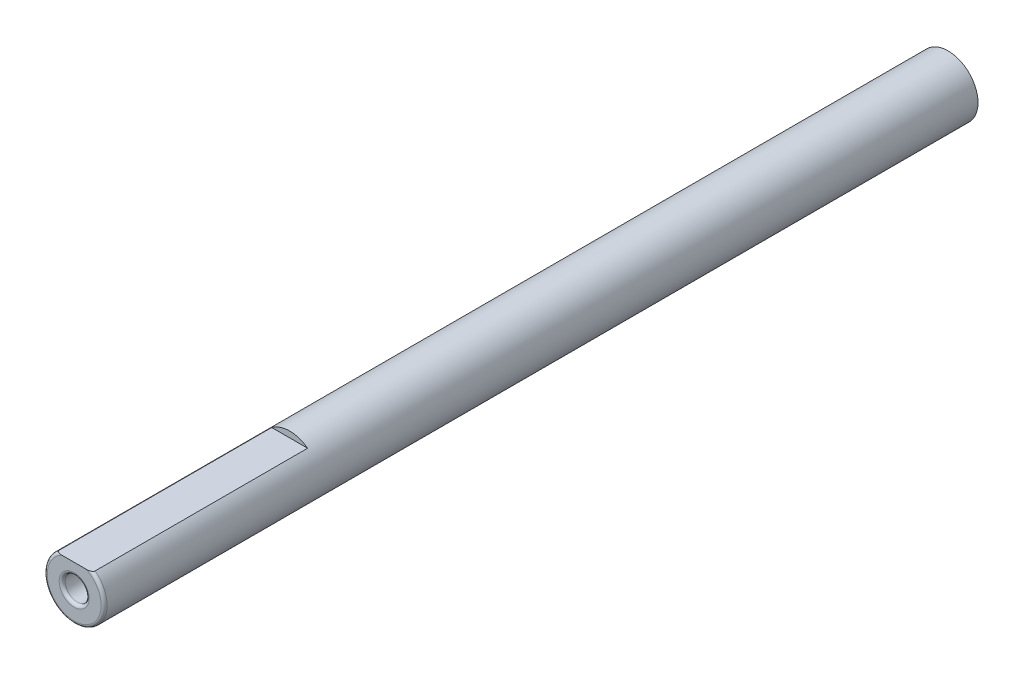
ISO-10303-21;
HEADER;
FILE_DESCRIPTION(('STEP AP214'),'2;1');
FILE_NAME('part.step','',(''),(''),'','','');
FILE_SCHEMA(('AUTOMOTIVE_DESIGN { 1 0 10303 214 1 1 1 1 }'));
ENDSEC;
DATA;
#1=APPLICATION_CONTEXT('core data for automotive mechanical design processes');
#2=APPLICATION_PROTOCOL_DEFINITION('international standard','automotive_design',2000,#1);
#3=PRODUCT_CONTEXT('',#1,'mechanical');
#4=PRODUCT('Part','Part','',(#3));
#5=PRODUCT_RELATED_PRODUCT_CATEGORY('part','',(#4));
#6=PRODUCT_DEFINITION_FORMATION('','',#4);
#7=PRODUCT_DEFINITION_CONTEXT('part definition',#1,'design');
#8=PRODUCT_DEFINITION('design','',#6,#7);
#9=PRODUCT_DEFINITION_SHAPE('','',#8);
#10=(LENGTH_UNIT() NAMED_UNIT(*) SI_UNIT(.MILLI.,.METRE.));
#11=(NAMED_UNIT(*) PLANE_ANGLE_UNIT() SI_UNIT($,.RADIAN.));
#12=(NAMED_UNIT(*) SI_UNIT($,.STERADIAN.) SOLID_ANGLE_UNIT());
#13=UNCERTAINTY_MEASURE_WITH_UNIT(LENGTH_MEASURE(1.E-05),#10,'distance_accuracy_value','');
#14=(GEOMETRIC_REPRESENTATION_CONTEXT(3) GLOBAL_UNCERTAINTY_ASSIGNED_CONTEXT((#13)) GLOBAL_UNIT_ASSIGNED_CONTEXT((#10,
#11,#12)) REPRESENTATION_CONTEXT('',''));
#15=CARTESIAN_POINT('',(0.,0.,0.));
#16=DIRECTION('',(0.,0.,1.));
#17=DIRECTION('',(1.,0.,0.));
#18=AXIS2_PLACEMENT_3D('',#15,#16,#17);
#19=CARTESIAN_POINT('',(0.,0.,73.));
#20=DIRECTION('',(0.,0.,-1.));
#21=DIRECTION('',(-1.,0.,0.));
#22=AXIS2_PLACEMENT_3D('',#19,#20,#21);
#23=CYLINDRICAL_SURFACE('',#22,2.5);
#24=CARTESIAN_POINT('',(0.,0.,72.75));
#25=DIRECTION('',(0.,0.,1.));
#26=DIRECTION('',(1.,0.,0.));
#27=AXIS2_PLACEMENT_3D('',#24,#25,#26);
#28=CIRCLE('',#27,2.5);
#29=CARTESIAN_POINT('',(1.5,2.,72.7499999999999));
#30=VERTEX_POINT('',#29);
#31=CARTESIAN_POINT('',(-1.5,2.,72.7500000000001));
#32=VERTEX_POINT('',#31);
#33=EDGE_CURVE('E84',#30,#32,#28,.F.);
#34=ORIENTED_EDGE('',*,*,#33,.T.);
#35=DIRECTION('',(0.,0.,1.));
#36=VECTOR('',#35,1.);
#37=CARTESIAN_POINT('',(-1.5,2.,55.));
#38=LINE('',#37,#36);
#39=CARTESIAN_POINT('',(-1.5,2.,55.));
#40=VERTEX_POINT('',#39);
#41=EDGE_CURVE('E77',#40,#32,#38,.T.);
#42=ORIENTED_EDGE('',*,*,#41,.F.);
#43=CARTESIAN_POINT('',(0.,0.,55.));
#44=DIRECTION('',(0.,0.,1.));
#45=DIRECTION('',(1.,0.,0.));
#46=AXIS2_PLACEMENT_3D('',#43,#44,#45);
#47=CIRCLE('',#46,2.5);
#48=CARTESIAN_POINT('',(1.5,2.,55.));
#49=VERTEX_POINT('',#48);
#50=EDGE_CURVE('E69',#49,#40,#47,.T.);
#51=ORIENTED_EDGE('',*,*,#50,.F.);
#52=DIRECTION('',(0.,0.,1.));
#53=VECTOR('',#52,1.);
#54=CARTESIAN_POINT('',(1.5,2.,55.));
#55=LINE('',#54,#53);
#56=EDGE_CURVE('E79',#49,#30,#55,.T.);
#57=ORIENTED_EDGE('',*,*,#56,.T.);
#58=EDGE_LOOP('',(#34,#42,#51,#57));
#59=FACE_BOUND('',#58,.T.);
#60=CARTESIAN_POINT('',(0.,0.,0.));
#61=DIRECTION('',(0.,0.,1.));
#62=DIRECTION('',(1.,0.,0.));
#63=AXIS2_PLACEMENT_3D('',#60,#61,#62);
#64=CIRCLE('',#63,2.5);
#65=CARTESIAN_POINT('',(2.5,0.,0.));
#66=VERTEX_POINT('',#65);
#67=EDGE_CURVE('E92',#66,#66,#64,.T.);
#68=ORIENTED_EDGE('',*,*,#67,.T.);
#69=EDGE_LOOP('',(#68));
#70=FACE_BOUND('',#69,.T.);
#71=ADVANCED_FACE('F34',(#59,#70),#23,.T.);
#72=CARTESIAN_POINT('',(0.,0.,73.));
#73=DIRECTION('',(0.,0.,1.));
#74=DIRECTION('',(1.,0.,0.));
#75=AXIS2_PLACEMENT_3D('',#72,#73,#74);
#76=PLANE('',#75);
#77=DIRECTION('',(1.,0.,0.));
#78=VECTOR('',#77,1.);
#79=CARTESIAN_POINT('',(-1.5,2.,73.));
#80=LINE('',#79,#78);
#81=CARTESIAN_POINT('',(-1.03077640640442,2.,73.));
#82=VERTEX_POINT('',#81);
#83=CARTESIAN_POINT('',(1.03077640640442,2.,73.));
#84=VERTEX_POINT('',#83);
#85=EDGE_CURVE('E52',#82,#84,#80,.T.);
#86=ORIENTED_EDGE('',*,*,#85,.F.);
#87=CARTESIAN_POINT('',(0.,0.,73.));
#88=DIRECTION('',(0.,0.,1.));
#89=DIRECTION('',(1.,0.,0.));
#90=AXIS2_PLACEMENT_3D('',#87,#88,#89);
#91=CIRCLE('',#90,2.25);
#92=EDGE_CURVE('E99',#82,#84,#91,.T.);
#93=ORIENTED_EDGE('',*,*,#92,.T.);
#94=EDGE_LOOP('',(#86,#93));
#95=FACE_BOUND('',#94,.T.);
#96=CARTESIAN_POINT('',(0.,0.,73.));
#97=DIRECTION('',(0.,0.,1.));
#98=DIRECTION('',(1.,0.,0.));
#99=AXIS2_PLACEMENT_3D('',#96,#97,#98);
#100=CIRCLE('',#99,1.25);
#101=CARTESIAN_POINT('',(1.25,0.,73.));
#102=VERTEX_POINT('',#101);
#103=EDGE_CURVE('E96',#102,#102,#100,.F.);
#104=ORIENTED_EDGE('',*,*,#103,.T.);
#105=EDGE_LOOP('',(#104));
#106=FACE_BOUND('',#105,.T.);
#107=ADVANCED_FACE('F125',(#95,#106),#76,.T.);
#108=CARTESIAN_POINT('',(0.,0.,0.));
#109=DIRECTION('',(0.,0.,1.));
#110=DIRECTION('',(1.,0.,0.));
#111=AXIS2_PLACEMENT_3D('',#108,#109,#110);
#112=PLANE('',#111);
#113=ORIENTED_EDGE('',*,*,#67,.F.);
#114=EDGE_LOOP('',(#113));
#115=FACE_BOUND('',#114,.T.);
#116=ADVANCED_FACE('F123',(#115),#112,.F.);
#117=CARTESIAN_POINT('',(0.,0.,63.));
#118=DIRECTION('',(0.,0.,1.));
#119=DIRECTION('',(1.,0.,0.));
#120=AXIS2_PLACEMENT_3D('',#117,#118,#119);
#121=CYLINDRICAL_SURFACE('',#120,1.);
#122=CARTESIAN_POINT('',(0.,0.,72.75));
#123=DIRECTION('',(0.,0.,1.));
#124=DIRECTION('',(1.,0.,0.));
#125=AXIS2_PLACEMENT_3D('',#122,#123,#124);
#126=CIRCLE('',#125,1.);
#127=CARTESIAN_POINT('',(1.,0.,72.75));
#128=VERTEX_POINT('',#127);
#129=EDGE_CURVE('E103',#128,#128,#126,.T.);
#130=ORIENTED_EDGE('',*,*,#129,.T.);
#131=EDGE_LOOP('',(#130));
#132=FACE_BOUND('',#131,.T.);
#133=CARTESIAN_POINT('',(0.,0.,63.));
#134=DIRECTION('',(0.,0.,1.));
#135=DIRECTION('',(1.,0.,0.));
#136=AXIS2_PLACEMENT_3D('',#133,#134,#135);
#137=CIRCLE('',#136,1.);
#138=CARTESIAN_POINT('',(1.,0.,63.));
#139=VERTEX_POINT('',#138);
#140=EDGE_CURVE('E86',#139,#139,#137,.T.);
#141=ORIENTED_EDGE('',*,*,#140,.F.);
#142=EDGE_LOOP('',(#141));
#143=FACE_BOUND('',#142,.T.);
#144=ADVANCED_FACE('F119',(#132,#143),#121,.F.);
#145=CARTESIAN_POINT('',(0.,0.,63.));
#146=DIRECTION('',(0.,0.,1.));
#147=DIRECTION('',(1.,0.,0.));
#148=AXIS2_PLACEMENT_3D('',#145,#146,#147);
#149=PLANE('',#148);
#150=ORIENTED_EDGE('',*,*,#140,.T.);
#151=EDGE_LOOP('',(#150));
#152=FACE_BOUND('',#151,.T.);
#153=ADVANCED_FACE('F115',(#152),#149,.T.);
#154=CARTESIAN_POINT('',(0.,0.,72.75));
#155=DIRECTION('',(0.,0.,1.));
#156=DIRECTION('',(1.,0.,0.));
#157=AXIS2_PLACEMENT_3D('',#154,#155,#156);
#158=TOROIDAL_SURFACE('',#157,2.25,0.25);
#159=CARTESIAN_POINT('',(0.,2.,72.75));
#160=CARTESIAN_POINT('',(4.60447977303265E-11,2.,72.7499994316429));
#161=CARTESIAN_POINT('',(-1.41908550602303E-07,2.,72.7499988632743));
#162=CARTESIAN_POINT('',(-5.76353339906845E-07,2.,72.7499977781027));
#163=CARTESIAN_POINT('',(-8.74667841472388E-07,2.,72.7499972642924));
#164=CARTESIAN_POINT('',(-1.58830851072497E-06,2.,72.7499962318158));
#165=CARTESIAN_POINT('',(-2.01336970471725E-06,2.,72.7499957199378));
#166=CARTESIAN_POINT('',(-2.92050402588945E-06,2.,72.7499947653601));
#167=CARTESIAN_POINT('',(-3.40176908275082E-06,2.,72.7499943218515));
#168=CARTESIAN_POINT('',(-5.16120523871155E-06,2.,72.7499927957832));
#169=CARTESIAN_POINT('',(-6.51185935230377E-06,2.,72.7499917950806));
#170=CARTESIAN_POINT('',(-9.27139545432669E-06,2.,72.7499900473241));
#171=CARTESIAN_POINT('',(-1.06743625450931E-05,2.,72.7499892903939));
#172=CARTESIAN_POINT('',(-1.62751541471673E-05,2.,72.7499863594714));
#173=CARTESIAN_POINT('',(-2.05492369434243E-05,2.,72.7499843227497));
#174=CARTESIAN_POINT('',(-2.88801261241239E-05,2.,72.7499810780406));
#175=CARTESIAN_POINT('',(-3.29122661772375E-05,2.,72.7499798052807));
#176=CARTESIAN_POINT('',(-5.04259066721469E-05,2.,72.7499742542971));
#177=CARTESIAN_POINT('',(-6.38826425216419E-05,2.,72.7499699305427));
#178=CARTESIAN_POINT('',(-8.88660289024995E-05,2.,72.7499631374884));
#179=CARTESIAN_POINT('',(-0.000100338676296863,2.,72.7499604789156));
#180=CARTESIAN_POINT('',(-0.000185124340216107,2.,72.7499390482678));
#181=CARTESIAN_POINT('',(-0.000255773108726864,2.,72.7499112057745));
#182=CARTESIAN_POINT('',(-0.000532607014025581,2.,72.7498060419901));
#183=CARTESIAN_POINT('',(-0.000740642204593965,2.,72.7497354879975));
#184=CARTESIAN_POINT('',(-0.00155567627210226,2.,72.7494550516329));
#185=CARTESIAN_POINT('',(-0.00216078794606,2.,72.7492380769761));
#186=CARTESIAN_POINT('',(-0.00465350185408532,2.,72.7483483993295));
#187=CARTESIAN_POINT('',(-0.00654317925328613,2.,72.7476837068595));
#188=CARTESIAN_POINT('',(-0.0300915261017926,2.,72.7393953655063));
#189=CARTESIAN_POINT('',(-0.0517374851104857,2.,72.7317214729732));
#190=CARTESIAN_POINT('',(-0.0942333116038087,2.,72.7167477137537));
#191=CARTESIAN_POINT('',(-0.115082176781415,2.,72.7094447144517));
#192=CARTESIAN_POINT('',(-0.159322374256499,2.,72.6940525866924));
#193=CARTESIAN_POINT('',(-0.182717690014827,2.,72.6859746349159));
#194=CARTESIAN_POINT('',(-0.229815647900605,2.,72.669919309923));
#195=CARTESIAN_POINT('',(-0.253518947339876,2.,72.6619438690271));
#196=CARTESIAN_POINT('',(-0.311826142248261,2.,72.6426698197981));
#197=CARTESIAN_POINT('',(-0.346477126851886,2.,72.6315123163205));
#198=CARTESIAN_POINT('',(-0.415171679035175,2.,72.6102184444254));
#199=CARTESIAN_POINT('',(-0.449209574097834,2.,72.6000638634305));
#200=CARTESIAN_POINT('',(-0.524827793365206,2.,72.5786480090876));
#201=CARTESIAN_POINT('',(-0.566472539762494,2.,72.5676107181456));
#202=CARTESIAN_POINT('',(-0.650541284700983,2.,72.5473352607342));
#203=CARTESIAN_POINT('',(-0.692968806795766,2.,72.5381114956025));
#204=CARTESIAN_POINT('',(-0.781376171359561,2.,72.5215918239718));
#205=CARTESIAN_POINT('',(-0.82739214697705,2.,72.5144821434608));
#206=CARTESIAN_POINT('',(-0.919736872009351,2.,72.5041122818566));
#207=CARTESIAN_POINT('',(-0.966064272962934,2.,72.5008406421505));
#208=CARTESIAN_POINT('',(-1.05795604981798,2.,72.4994507366684));
#209=CARTESIAN_POINT('',(-1.10351709384425,2.,72.5012304297803));
#210=CARTESIAN_POINT('',(-1.17088745971757,2.,72.509007957349));
#211=CARTESIAN_POINT('',(-1.19299708974847,2.,72.5124015898682));
#212=CARTESIAN_POINT('',(-1.23680593555489,2.,72.5211858923293));
#213=CARTESIAN_POINT('',(-1.25850564230334,2.,72.5265739899152));
#214=CARTESIAN_POINT('',(-1.29544204153703,2.,72.5380012323008));
#215=CARTESIAN_POINT('',(-1.31085143131575,2.,72.5434783330444));
#216=CARTESIAN_POINT('',(-1.34110600031854,2.,72.5559663060975));
#217=CARTESIAN_POINT('',(-1.35594925807522,2.,72.5629819357195));
#218=CARTESIAN_POINT('',(-1.38479216759413,2.,72.5788548815429));
#219=CARTESIAN_POINT('',(-1.39878393065522,2.,72.5877267850515));
#220=CARTESIAN_POINT('',(-1.42520200026815,2.,72.6075539977369));
#221=CARTESIAN_POINT('',(-1.43763283447314,2.,72.6185030385383));
#222=CARTESIAN_POINT('',(-1.45594558128021,2.,72.6382661622678));
#223=CARTESIAN_POINT('',(-1.46256060850522,2.,72.6463981694095));
#224=CARTESIAN_POINT('',(-1.47448734144706,2.,72.6635801193661));
#225=CARTESIAN_POINT('',(-1.47979954325568,2.,72.6726297109208));
#226=CARTESIAN_POINT('',(-1.4888042831766,2.,72.6916429485455));
#227=CARTESIAN_POINT('',(-1.49247789218271,2.,72.7016157469127));
#228=CARTESIAN_POINT('',(-1.4977546215247,2.,72.7220946264925));
#229=CARTESIAN_POINT('',(-1.4993607714795,2.,72.7325999038847));
#230=CARTESIAN_POINT('',(-1.50025612399369,2.,72.7521656496195));
#231=CARTESIAN_POINT('',(-1.49984935091474,2.,72.7612131412387));
#232=CARTESIAN_POINT('',(-1.49743800054558,2.,72.7790915807672));
#233=CARTESIAN_POINT('',(-1.49543319727238,2.,72.7879224978678));
#234=CARTESIAN_POINT('',(-1.49011626106806,2.,72.8047173917484));
#235=CARTESIAN_POINT('',(-1.48686986628215,2.,72.8127026038318));
#236=CARTESIAN_POINT('',(-1.47927184985139,2.,72.8281220840651));
#237=CARTESIAN_POINT('',(-1.47491993343345,2.,72.8355562045894));
#238=CARTESIAN_POINT('',(-1.46269764328602,2.,72.8536899008064));
#239=CARTESIAN_POINT('',(-1.45420072584848,2.,72.8639674141153));
#240=CARTESIAN_POINT('',(-1.43568647628947,2.,72.8830542623536));
#241=CARTESIAN_POINT('',(-1.42566468441951,2.,72.8918591262967));
#242=CARTESIAN_POINT('',(-1.39857920170747,2.,72.9127249221272));
#243=CARTESIAN_POINT('',(-1.38075240757578,2.,72.9237893243213));
#244=CARTESIAN_POINT('',(-1.34369856944897,2.,72.9431007540513));
#245=CARTESIAN_POINT('',(-1.32447116450517,2.,72.9513470522007));
#246=CARTESIAN_POINT('',(-1.26994219182624,2.,72.9710829325379));
#247=CARTESIAN_POINT('',(-1.23376006001226,2.,72.9801133803287));
#248=CARTESIAN_POINT('',(-1.16013658314661,2.,72.9930436841324));
#249=CARTESIAN_POINT('',(-1.12268499148503,2.,72.9968754570902));
#250=CARTESIAN_POINT('',(-1.04579087740824,2.,73.0006213397396));
#251=CARTESIAN_POINT('',(-1.00633987556636,2.,73.0003364681251));
#252=CARTESIAN_POINT('',(-0.927531406020384,2.,72.9963988575985));
#253=CARTESIAN_POINT('',(-0.888174458526564,2.,72.9927372482254));
#254=CARTESIAN_POINT('',(-0.811901156366958,2.,72.9830511422734));
#255=CARTESIAN_POINT('',(-0.774966747019161,2.,72.9771633343099));
#256=CARTESIAN_POINT('',(-0.701685223215932,2.,72.96356089772));
#257=CARTESIAN_POINT('',(-0.665335870587718,2.,72.9558580770136));
#258=CARTESIAN_POINT('',(-0.58391137086121,2.,72.9368764373918));
#259=CARTESIAN_POINT('',(-0.538933431232725,2.,72.9251852474934));
#260=CARTESIAN_POINT('',(-0.448377262369036,2.,72.8998306275539));
#261=CARTESIAN_POINT('',(-0.402810630561023,2.,72.8861265101856));
#262=CARTESIAN_POINT('',(-0.3265122946677,2.,72.8620713997275));
#263=CARTESIAN_POINT('',(-0.295677630405276,2.,72.8520424549339));
#264=CARTESIAN_POINT('',(-0.234465688968832,2.,72.8316830489772));
#265=CARTESIAN_POINT('',(-0.204086998858635,2.,72.8213568325791));
#266=CARTESIAN_POINT('',(-0.146686277930417,2.,72.8015866863205));
#267=CARTESIAN_POINT('',(-0.119655506533312,2.,72.7921676795406));
#268=CARTESIAN_POINT('',(-0.0645649660808965,2.,72.7728082194009));
#269=CARTESIAN_POINT('',(-0.0365071115508402,2.,72.7628619428912));
#270=CARTESIAN_POINT('',(-0.00654211704730713,2.,72.7523159731014));
#271=CARTESIAN_POINT('',(-0.00465140018735257,2.,72.7516508728745));
#272=CARTESIAN_POINT('',(-0.00215844070804889,2.,72.7507610921868));
#273=CARTESIAN_POINT('',(-0.00155412671966729,2.,72.7505444048271));
#274=CARTESIAN_POINT('',(-0.00074009960082364,2.,72.7502643151903));
#275=CARTESIAN_POINT('',(-0.000532271204908929,2.,72.7501938316014));
#276=CARTESIAN_POINT('',(-0.000255678863852791,2.,72.7500887612275));
#277=CARTESIAN_POINT('',(-0.000185066943918879,2.,72.7500609333125));
#278=CARTESIAN_POINT('',(-0.000100322608490237,2.,72.7500395106224));
#279=CARTESIAN_POINT('',(-8.88525266506745E-05,2.,72.7500368523305));
#280=CARTESIAN_POINT('',(-6.38748846006629E-05,2.,72.7500300610194));
#281=CARTESIAN_POINT('',(-5.04212595587593E-05,2.,72.7500257389672));
#282=CARTESIAN_POINT('',(-3.29110992125345E-05,2.,72.7500201900559));
#283=CARTESIAN_POINT('',(-2.88793376451717E-05,2.,72.7500189176432));
#284=CARTESIAN_POINT('',(-2.05491783617792E-05,2.,72.7500156738718));
#285=CARTESIAN_POINT('',(-1.62754315141246E-05,2.,72.7500136377687));
#286=CARTESIAN_POINT('',(-1.0674965165193E-05,2.,72.7500107076901));
#287=CARTESIAN_POINT('',(-9.27202715098322E-06,2.,72.75000995095));
#288=CARTESIAN_POINT('',(-6.51251274781188E-06,2.,72.7500082036104));
#289=CARTESIAN_POINT('',(-5.16184878506824E-06,2.,72.7500072031365));
#290=CARTESIAN_POINT('',(-3.40235596668459E-06,2.,72.7500056773855));
#291=CARTESIAN_POINT('',(-2.92106572946966E-06,2.,72.7500052339612));
#292=CARTESIAN_POINT('',(-2.0138658940959E-06,2.,72.7500042795533));
#293=CARTESIAN_POINT('',(-1.58876411934483E-06,2.,72.750003767761));
#294=CARTESIAN_POINT('',(-8.75025822030296E-07,2.,72.7500027354385));
#295=CARTESIAN_POINT('',(-5.76656751638861E-07,2.,72.7500022216969));
#296=CARTESIAN_POINT('',(-1.42078324048704E-07,2.,72.7500011366452));
#297=CARTESIAN_POINT('',(-4.60424628416048E-11,2.,72.7500005683283));
#298=CARTESIAN_POINT('',(0.,2.,72.75));
#299=B_SPLINE_CURVE_WITH_KNOTS('',3,(#159,#160,#161,#162,#163,#164,#165,#166,#167,#168,#169,
#170,#171,#172,#173,#174,#175,#176,#177,#178,#179,#180,#181,#182,#183,#184,#185,#186,#187,#188,
#189,#190,#191,#192,#193,#194,#195,#196,#197,#198,#199,#200,#201,#202,#203,#204,#205,#206,#207,
#208,#209,#210,#211,#212,#213,#214,#215,#216,#217,#218,#219,#220,#221,#222,#223,#224,#225,#226,
#227,#228,#229,#230,#231,#232,#233,#234,#235,#236,#237,#238,#239,#240,#241,#242,#243,#244,#245,
#246,#247,#248,#249,#250,#251,#252,#253,#254,#255,#256,#257,#258,#259,#260,#261,#262,#263,#264,
#265,#266,#267,#268,#269,#270,#271,#272,#273,#274,#275,#276,#277,#278,#279,#280,#281,#282,#283,
#284,#285,#286,#287,#288,#289,#290,#291,#292,#293,#294,#295,#296,#297,#298),.UNSPECIFIED.,.T.,
.F.,(4,2,2,2,2,2,2,2,2,2,2,2,2,2,2,2,2,2,2,2,2,2,2,2,2,2,2,2,2,2,2,2,2,2,2,2,2,2,2,2,2,2,2,2,2,
2,2,2,2,2,2,2,2,2,2,2,2,2,2,2,2,2,2,2,2,2,2,2,2,4),(0.,1.70593035754983E-06,3.4804658583349E-06,
5.46753033564972E-06,7.42890667995629E-06,1.24485924666463E-05,1.72271182687607E-05,
3.13927484906151E-05,4.40635450768334E-05,8.64616498880931E-05,0.000121762237206279,
0.000348850482877824,0.00100847484033568,0.00293621966333802,0.00894655901506832,
0.0778383472405246,0.144112489335173,0.218363391967703,0.293389980060125,0.402592342745507,
0.509143961873857,0.638358099772787,0.768560207489545,0.908121033225023,1.04726412591419,
1.18361653594968,1.2506541534458,1.31760560891086,1.36660331871871,1.41575472682726,
1.46530795846393,1.51471396126739,1.5460644460136,1.57740297447624,1.60909470217474,
1.64073993629355,1.66776519339683,1.6947942729133,1.72055542472725,1.74632345264265,
1.78610098132831,1.82599716528658,1.88858578653762,1.95119059483526,2.06244350384283,
2.17513978134689,2.2933008128236,2.41177313223176,2.52391605555674,2.63534862894128,
2.77471957137366,2.91744408194628,3.01471503377711,3.11096974529615,3.19684574578844,
3.2861434934468,3.29215717001634,3.29408237339145,3.29474134143121,3.29496831139007,
3.29500360432053,3.29504599202879,3.29505866143623,3.29507282538385,3.29507760356316,
3.29508262287079,3.29508458413177,3.29508657107786,3.29508834551867,3.29509005136252),.UNSPECIFIED.);
#300=EDGE_CURVE('E11',#32,#82,#299,.T.);
#301=ORIENTED_EDGE('',*,*,#300,.F.);
#302=ORIENTED_EDGE('',*,*,#33,.F.);
#303=CARTESIAN_POINT('',(0.,2.,72.75));
#304=CARTESIAN_POINT('',(-4.60434786703754E-11,2.,72.7500005683571));
#305=CARTESIAN_POINT('',(1.41908553257205E-07,2.,72.7500011367256));
#306=CARTESIAN_POINT('',(5.76353340426851E-07,2.,72.7500022218973));
#307=CARTESIAN_POINT('',(8.7466784046892E-07,2.,72.7500027357075));
#308=CARTESIAN_POINT('',(1.58830850927223E-06,2.,72.7500037681842));
#309=CARTESIAN_POINT('',(2.0133697043223E-06,2.,72.7500042800621));
#310=CARTESIAN_POINT('',(2.92050402628935E-06,2.,72.7500052346399));
#311=CARTESIAN_POINT('',(3.40176908290468E-06,2.,72.7500056781485));
#312=CARTESIAN_POINT('',(5.16120523834448E-06,2.,72.7500072042168));
#313=CARTESIAN_POINT('',(6.51185935221436E-06,2.,72.7500082049194));
#314=CARTESIAN_POINT('',(9.27139545444125E-06,2.,72.7500099526759));
#315=CARTESIAN_POINT('',(1.06743625451502E-05,2.,72.7500107096061));
#316=CARTESIAN_POINT('',(1.62751541470862E-05,2.,72.7500136405286));
#317=CARTESIAN_POINT('',(2.05492369434346E-05,2.,72.7500156772503));
#318=CARTESIAN_POINT('',(2.88801261242058E-05,2.,72.7500189219594));
#319=CARTESIAN_POINT('',(3.29122661773103E-05,2.,72.7500201947193));
#320=CARTESIAN_POINT('',(5.04259066722136E-05,2.,72.7500257457029));
#321=CARTESIAN_POINT('',(6.38826425217683E-05,2.,72.7500300694573));
#322=CARTESIAN_POINT('',(8.88660289027005E-05,2.,72.7500368625116));
#323=CARTESIAN_POINT('',(0.000100338676297084,2.,72.7500395210844));
#324=CARTESIAN_POINT('',(0.000185124340216527,2.,72.7500609517322));
#325=CARTESIAN_POINT('',(0.000255773108727507,2.,72.7500887942255));
#326=CARTESIAN_POINT('',(0.000532607014027112,2.,72.7501939580099));
#327=CARTESIAN_POINT('',(0.000740642204596138,2.,72.7502645120024));
#328=CARTESIAN_POINT('',(0.00155567627210431,2.,72.7505449483671));
#329=CARTESIAN_POINT('',(0.00216078794606098,2.,72.7507619230239));
#330=CARTESIAN_POINT('',(0.00465350185408482,2.,72.7516516006705));
#331=CARTESIAN_POINT('',(0.0065431792532859,2.,72.7523162931405));
#332=CARTESIAN_POINT('',(0.0300915261017958,2.,72.7606046344937));
#333=CARTESIAN_POINT('',(0.0517374851104877,2.,72.7682785270267));
#334=CARTESIAN_POINT('',(0.0942333116038076,2.,72.7832522862463));
#335=CARTESIAN_POINT('',(0.115082176781412,2.,72.7905552855483));
#336=CARTESIAN_POINT('',(0.159322374256495,2.,72.8059474133076));
#337=CARTESIAN_POINT('',(0.182717690014826,2.,72.8140253650841));
#338=CARTESIAN_POINT('',(0.229815647900605,2.,72.830080690077));
#339=CARTESIAN_POINT('',(0.253518947339875,2.,72.8380561309729));
#340=CARTESIAN_POINT('',(0.311826142248259,2.,72.8573301802019));
#341=CARTESIAN_POINT('',(0.346477126851886,2.,72.8684876836795));
#342=CARTESIAN_POINT('',(0.415171679035175,2.,72.8897815555746));
#343=CARTESIAN_POINT('',(0.449209574097834,2.,72.8999361365695));
#344=CARTESIAN_POINT('',(0.524827793365206,2.,72.9213519909124));
#345=CARTESIAN_POINT('',(0.566472539762494,2.,72.9323892818544));
#346=CARTESIAN_POINT('',(0.650541284700983,2.,72.9526647392658));
#347=CARTESIAN_POINT('',(0.692968806795766,2.,72.9618885043975));
#348=CARTESIAN_POINT('',(0.781376171359561,2.,72.9784081760281));
#349=CARTESIAN_POINT('',(0.82739214697705,2.,72.9855178565392));
#350=CARTESIAN_POINT('',(0.919736872009351,2.,72.9958877181434));
#351=CARTESIAN_POINT('',(0.966064272962934,2.,72.9991593578495));
#352=CARTESIAN_POINT('',(1.05795604981798,2.,73.0005492633316));
#353=CARTESIAN_POINT('',(1.10351709384425,2.,72.9987695702196));
#354=CARTESIAN_POINT('',(1.17088745971757,2.,72.990992042651));
#355=CARTESIAN_POINT('',(1.19299708974847,2.,72.9875984101318));
#356=CARTESIAN_POINT('',(1.23680593555489,2.,72.9788141076707));
#357=CARTESIAN_POINT('',(1.25850564230334,2.,72.9734260100848));
#358=CARTESIAN_POINT('',(1.29544204153703,2.,72.9619987676992));
#359=CARTESIAN_POINT('',(1.31085143131576,2.,72.9565216669556));
#360=CARTESIAN_POINT('',(1.34110600031855,2.,72.9440336939025));
#361=CARTESIAN_POINT('',(1.35594925807522,2.,72.9370180642805));
#362=CARTESIAN_POINT('',(1.38479216759413,2.,72.9211451184571));
#363=CARTESIAN_POINT('',(1.39878393065521,2.,72.9122732149485));
#364=CARTESIAN_POINT('',(1.42520200026814,2.,72.8924460022631));
#365=CARTESIAN_POINT('',(1.43763283447314,2.,72.8814969614617));
#366=CARTESIAN_POINT('',(1.45594558128021,2.,72.8617338377322));
#367=CARTESIAN_POINT('',(1.46256060850522,2.,72.8536018305905));
#368=CARTESIAN_POINT('',(1.47448734144706,2.,72.8364198806339));
#369=CARTESIAN_POINT('',(1.47979954325568,2.,72.8273702890792));
#370=CARTESIAN_POINT('',(1.4888042831766,2.,72.8083570514545));
#371=CARTESIAN_POINT('',(1.49247789218271,2.,72.7983842530873));
#372=CARTESIAN_POINT('',(1.4977546215247,2.,72.7779053735075));
#373=CARTESIAN_POINT('',(1.4993607714795,2.,72.7674000961153));
#374=CARTESIAN_POINT('',(1.50025612399369,2.,72.7478343503805));
#375=CARTESIAN_POINT('',(1.49984935091474,2.,72.7387868587613));
#376=CARTESIAN_POINT('',(1.49743800054558,2.,72.7209084192328));
#377=CARTESIAN_POINT('',(1.49543319727238,2.,72.7120775021322));
#378=CARTESIAN_POINT('',(1.49011626106806,2.,72.6952826082516));
#379=CARTESIAN_POINT('',(1.48686986628215,2.,72.6872973961681));
#380=CARTESIAN_POINT('',(1.47927184985139,2.,72.6718779159349));
#381=CARTESIAN_POINT('',(1.47491993343345,2.,72.6644437954106));
#382=CARTESIAN_POINT('',(1.46269764328602,2.,72.6463100991936));
#383=CARTESIAN_POINT('',(1.45420072584847,2.,72.6360325858847));
#384=CARTESIAN_POINT('',(1.43568647628946,2.,72.6169457376464));
#385=CARTESIAN_POINT('',(1.4256646844195,2.,72.6081408737033));
#386=CARTESIAN_POINT('',(1.39857920170747,2.,72.5872750778728));
#387=CARTESIAN_POINT('',(1.38075240757578,2.,72.5762106756787));
#388=CARTESIAN_POINT('',(1.34369856944897,2.,72.5568992459487));
#389=CARTESIAN_POINT('',(1.32447116450517,2.,72.5486529477993));
#390=CARTESIAN_POINT('',(1.26994219182624,2.,72.5289170674621));
#391=CARTESIAN_POINT('',(1.23376006001226,2.,72.5198866196713));
#392=CARTESIAN_POINT('',(1.16013658314661,2.,72.5069563158676));
#393=CARTESIAN_POINT('',(1.12268499148503,2.,72.5031245429098));
#394=CARTESIAN_POINT('',(1.04579087740824,2.,72.4993786602604));
#395=CARTESIAN_POINT('',(1.00633987556637,2.,72.4996635318749));
#396=CARTESIAN_POINT('',(0.927531406020385,2.,72.5036011424015));
#397=CARTESIAN_POINT('',(0.888174458526564,2.,72.5072627517746));
#398=CARTESIAN_POINT('',(0.811901156366958,2.,72.5169488577266));
#399=CARTESIAN_POINT('',(0.774966747019161,2.,72.5228366656901));
#400=CARTESIAN_POINT('',(0.701685223215932,2.,72.53643910228));
#401=CARTESIAN_POINT('',(0.665335870587718,2.,72.5441419229864));
#402=CARTESIAN_POINT('',(0.58391137086121,2.,72.5631235626082));
#403=CARTESIAN_POINT('',(0.538933431232725,2.,72.5748147525066));
#404=CARTESIAN_POINT('',(0.448377262369036,2.,72.6001693724461));
#405=CARTESIAN_POINT('',(0.402810630561023,2.,72.6138734898144));
#406=CARTESIAN_POINT('',(0.3265122946677,2.,72.6379286002725));
#407=CARTESIAN_POINT('',(0.295677630405277,2.,72.6479575450661));
#408=CARTESIAN_POINT('',(0.234465688968834,2.,72.6683169510228));
#409=CARTESIAN_POINT('',(0.204086998858638,2.,72.6786431674209));
#410=CARTESIAN_POINT('',(0.146686277930419,2.,72.6984133136795));
#411=CARTESIAN_POINT('',(0.119655506533312,2.,72.7078323204594));
#412=CARTESIAN_POINT('',(0.0645649660808963,2.,72.7271917805991));
#413=CARTESIAN_POINT('',(0.0365071115508408,2.,72.7371380571088));
#414=CARTESIAN_POINT('',(0.00654211704730709,2.,72.7476840268986));
#415=CARTESIAN_POINT('',(0.00465140018735248,2.,72.7483491271255));
#416=CARTESIAN_POINT('',(0.00215844070804892,2.,72.7492389078132));
#417=CARTESIAN_POINT('',(0.00155412671966737,2.,72.7494555951729));
#418=CARTESIAN_POINT('',(0.000740099600823663,2.,72.7497356848097));
#419=CARTESIAN_POINT('',(0.000532271204908962,2.,72.7498061683986));
#420=CARTESIAN_POINT('',(0.000255678863852962,2.,72.7499112387725));
#421=CARTESIAN_POINT('',(0.000185066943919074,2.,72.7499390666875));
#422=CARTESIAN_POINT('',(0.000100322608490192,2.,72.7499604893776));
#423=CARTESIAN_POINT('',(8.88525266504787E-05,2.,72.7499631476695));
#424=CARTESIAN_POINT('',(6.38748846004508E-05,2.,72.7499699389806));
#425=CARTESIAN_POINT('',(5.04212595586826E-05,2.,72.7499742610328));
#426=CARTESIAN_POINT('',(3.29110992125756E-05,2.,72.7499798099441));
#427=CARTESIAN_POINT('',(2.88793376452103E-05,2.,72.7499810823568));
#428=CARTESIAN_POINT('',(2.05491783618034E-05,2.,72.7499843261282));
#429=CARTESIAN_POINT('',(1.62754315141362E-05,2.,72.7499863622313));
#430=CARTESIAN_POINT('',(1.06749651652098E-05,2.,72.7499892923099));
#431=CARTESIAN_POINT('',(9.27202715100352E-06,2.,72.74999004905));
#432=CARTESIAN_POINT('',(6.51251274781249E-06,2.,72.7499917963896));
#433=CARTESIAN_POINT('',(5.16184878504438E-06,2.,72.7499927968634));
#434=CARTESIAN_POINT('',(3.40235596670117E-06,2.,72.7499943226144));
#435=CARTESIAN_POINT('',(2.92106572950588E-06,2.,72.7499947660388));
#436=CARTESIAN_POINT('',(2.01386589406626E-06,2.,72.7499957204467));
#437=CARTESIAN_POINT('',(1.58876411922834E-06,2.,72.749996232239));
#438=CARTESIAN_POINT('',(8.75025822137661E-07,2.,72.7499972645615));
#439=CARTESIAN_POINT('',(5.76656752015406E-07,2.,72.7499977783031));
#440=CARTESIAN_POINT('',(1.42078323687811E-07,2.,72.7499988633548));
#441=CARTESIAN_POINT('',(4.60411442148932E-11,2.,72.7499994316717));
#442=CARTESIAN_POINT('',(0.,2.,72.75));
#443=B_SPLINE_CURVE_WITH_KNOTS('',3,(#303,#304,#305,#306,#307,#308,#309,#310,#311,#312,#313,
#314,#315,#316,#317,#318,#319,#320,#321,#322,#323,#324,#325,#326,#327,#328,#329,#330,#331,#332,
#333,#334,#335,#336,#337,#338,#339,#340,#341,#342,#343,#344,#345,#346,#347,#348,#349,#350,#351,
#352,#353,#354,#355,#356,#357,#358,#359,#360,#361,#362,#363,#364,#365,#366,#367,#368,#369,#370,
#371,#372,#373,#374,#375,#376,#377,#378,#379,#380,#381,#382,#383,#384,#385,#386,#387,#388,#389,
#390,#391,#392,#393,#394,#395,#396,#397,#398,#399,#400,#401,#402,#403,#404,#405,#406,#407,#408,
#409,#410,#411,#412,#413,#414,#415,#416,#417,#418,#419,#420,#421,#422,#423,#424,#425,#426,#427,
#428,#429,#430,#431,#432,#433,#434,#435,#436,#437,#438,#439,#440,#441,#442),.UNSPECIFIED.,.T.,
.F.,(4,2,2,2,2,2,2,2,2,2,2,2,2,2,2,2,2,2,2,2,2,2,2,2,2,2,2,2,2,2,2,2,2,2,2,2,2,2,2,2,2,2,2,2,2,
2,2,2,2,2,2,2,2,2,2,2,2,2,2,2,2,2,2,2,2,2,2,2,2,4),(0.,1.70593034397578E-06,
3.48046585691602E-06,5.46753033423238E-06,7.42890667854064E-06,1.24485924652368E-05,
1.7227118267357E-05,3.13927484892357E-05,4.40635450754738E-05,8.64616498868282E-05,
0.000121762237205087,0.000348850482877217,0.00100847484033687,0.0029362196633366,
0.0089465590150669,0.0778383472405245,0.144112489335168,0.218363391967695,0.293389980060123,
0.402592342745506,0.509143961873855,0.638358099772785,0.768560207489543,0.908121033225021,
1.04726412591419,1.18361653594968,1.2506541534458,1.31760560891086,1.36660331871872,
1.41575472682725,1.46530795846392,1.51471396126739,1.5460644460136,1.57740297447624,
1.60909470217474,1.64073993629354,1.66776519339683,1.6947942729133,1.72055542472725,
1.74632345264265,1.78610098132833,1.82599716528657,1.88858578653762,1.95119059483526,
2.06244350384283,2.17513978134689,2.29330081282359,2.41177313223176,2.52391605555674,
2.63534862894127,2.77471957137366,2.91744408194627,3.0147150337771,3.11096974529614,
3.19684574578844,3.2861434934468,3.29215717001633,3.29408237339145,3.29474134143121,
3.29496831139006,3.29500360432053,3.29504599202879,3.29505866143623,3.29507282538385,
3.29507760356316,3.29508262287079,3.29508458413177,3.29508657107785,3.29508834551866,
3.29509005136252),.UNSPECIFIED.);
#444=EDGE_CURVE('E46',#84,#30,#443,.T.);
#445=ORIENTED_EDGE('',*,*,#444,.F.);
#446=ORIENTED_EDGE('',*,*,#92,.F.);
#447=EDGE_LOOP('',(#301,#302,#445,#446));
#448=FACE_BOUND('',#447,.T.);
#449=ADVANCED_FACE('F108',(#448),#158,.T.);
#450=CARTESIAN_POINT('',(0.,0.,72.75));
#451=DIRECTION('',(0.,0.,1.));
#452=DIRECTION('',(1.,0.,0.));
#453=AXIS2_PLACEMENT_3D('',#450,#451,#452);
#454=TOROIDAL_SURFACE('',#453,1.25,0.25);
#455=ORIENTED_EDGE('',*,*,#103,.F.);
#456=EDGE_LOOP('',(#455));
#457=FACE_BOUND('',#456,.T.);
#458=ORIENTED_EDGE('',*,*,#129,.F.);
#459=EDGE_LOOP('',(#458));
#460=FACE_BOUND('',#459,.T.);
#461=ADVANCED_FACE('F36',(#457,#460),#454,.T.);
#462=CARTESIAN_POINT('',(-1.5,2.,55.));
#463=DIRECTION('',(0.,-1.,0.));
#464=DIRECTION('',(0.,0.,-1.));
#465=AXIS2_PLACEMENT_3D('',#462,#463,#464);
#466=PLANE('',#465);
#467=ORIENTED_EDGE('',*,*,#300,.T.);
#468=ORIENTED_EDGE('',*,*,#85,.T.);
#469=ORIENTED_EDGE('',*,*,#444,.T.);
#470=ORIENTED_EDGE('',*,*,#56,.F.);
#471=DIRECTION('',(1.,0.,0.));
#472=VECTOR('',#471,1.);
#473=CARTESIAN_POINT('',(-1.5,2.,55.));
#474=LINE('',#473,#472);
#475=EDGE_CURVE('E72',#40,#49,#474,.T.);
#476=ORIENTED_EDGE('',*,*,#475,.F.);
#477=ORIENTED_EDGE('',*,*,#41,.T.);
#478=EDGE_LOOP('',(#467,#468,#469,#470,#476,#477));
#479=FACE_BOUND('',#478,.T.);
#480=ADVANCED_FACE('F76',(#479),#466,.F.);
#481=CARTESIAN_POINT('',(0.,0.,55.));
#482=DIRECTION('',(0.,0.,1.));
#483=DIRECTION('',(1.,0.,0.));
#484=AXIS2_PLACEMENT_3D('',#481,#482,#483);
#485=PLANE('',#484);
#486=ORIENTED_EDGE('',*,*,#50,.T.);
#487=ORIENTED_EDGE('',*,*,#475,.T.);
#488=EDGE_LOOP('',(#486,#487));
#489=FACE_BOUND('',#488,.T.);
#490=ADVANCED_FACE('F71',(#489),#485,.T.);
#491=CLOSED_SHELL('',(#71,#107,#116,#144,#153,#449,#461,#480,#490));
#492=MANIFOLD_SOLID_BREP('B2',#491);
#493=ADVANCED_BREP_SHAPE_REPRESENTATION('',(#18,#492),#14);
#494=SHAPE_DEFINITION_REPRESENTATION(#9,#493);
ENDSEC;
END-ISO-10303-21;
